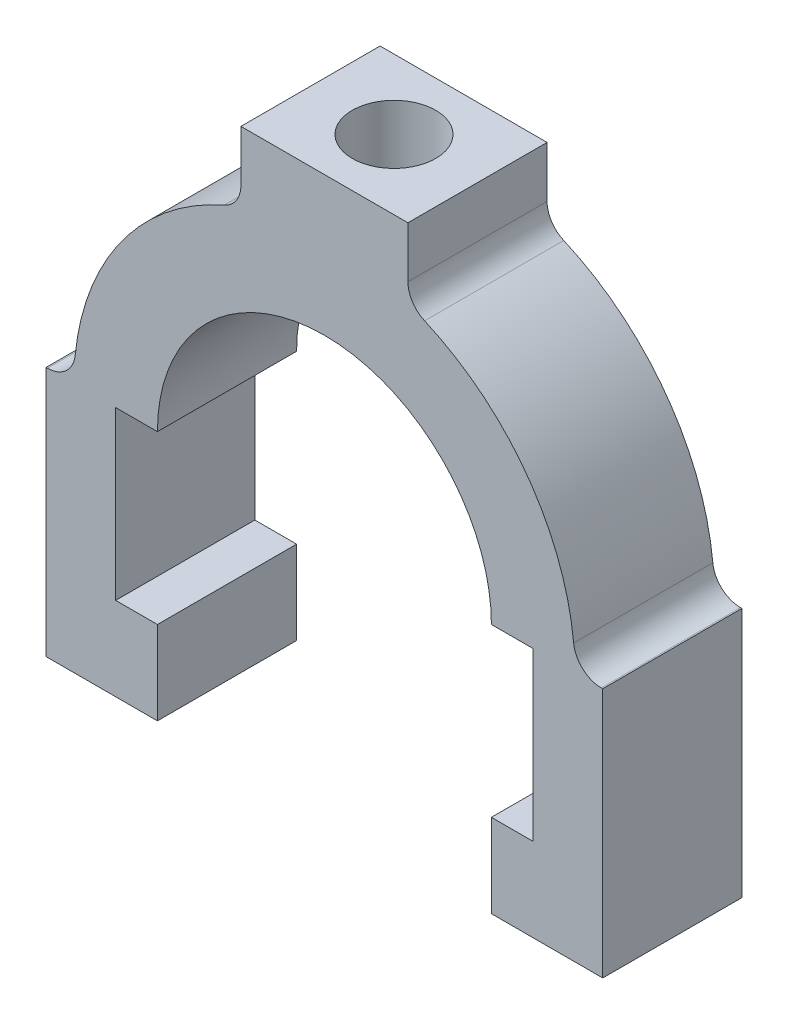
ISO-10303-21;
HEADER;
FILE_DESCRIPTION(('STEP AP214'),'2;1');
FILE_NAME('part.step','',(''),(''),'','','');
FILE_SCHEMA(('AUTOMOTIVE_DESIGN { 1 0 10303 214 1 1 1 1 }'));
ENDSEC;
DATA;
#1=APPLICATION_CONTEXT('core data for automotive mechanical design processes');
#2=APPLICATION_PROTOCOL_DEFINITION('international standard','automotive_design',2000,#1);
#3=PRODUCT_CONTEXT('',#1,'mechanical');
#4=PRODUCT('Part','Part','',(#3));
#5=PRODUCT_RELATED_PRODUCT_CATEGORY('part','',(#4));
#6=PRODUCT_DEFINITION_FORMATION('','',#4);
#7=PRODUCT_DEFINITION_CONTEXT('part definition',#1,'design');
#8=PRODUCT_DEFINITION('design','',#6,#7);
#9=PRODUCT_DEFINITION_SHAPE('','',#8);
#10=(LENGTH_UNIT() NAMED_UNIT(*) SI_UNIT(.MILLI.,.METRE.));
#11=(NAMED_UNIT(*) PLANE_ANGLE_UNIT() SI_UNIT($,.RADIAN.));
#12=(NAMED_UNIT(*) SI_UNIT($,.STERADIAN.) SOLID_ANGLE_UNIT());
#13=UNCERTAINTY_MEASURE_WITH_UNIT(LENGTH_MEASURE(1.E-05),#10,'distance_accuracy_value','');
#14=(GEOMETRIC_REPRESENTATION_CONTEXT(3) GLOBAL_UNCERTAINTY_ASSIGNED_CONTEXT((#13)) GLOBAL_UNIT_ASSIGNED_CONTEXT((#10,
#11,#12)) REPRESENTATION_CONTEXT('',''));
#15=CARTESIAN_POINT('',(0.,0.,0.));
#16=DIRECTION('',(0.,0.,1.));
#17=DIRECTION('',(1.,0.,0.));
#18=AXIS2_PLACEMENT_3D('',#15,#16,#17);
#19=CARTESIAN_POINT('',(70.,36.,-20.));
#20=DIRECTION('',(0.,1.,0.));
#21=DIRECTION('',(0.,0.,1.));
#22=AXIS2_PLACEMENT_3D('',#19,#20,#21);
#23=PLANE('',#22);
#24=DIRECTION('',(-1.,0.,0.));
#25=VECTOR('',#24,1.);
#26=CARTESIAN_POINT('',(70.,36.,-20.));
#27=LINE('',#26,#25);
#28=CARTESIAN_POINT('',(15.9999999999999,36.,-20.));
#29=VERTEX_POINT('',#28);
#30=CARTESIAN_POINT('',(9.99999999999975,36.,-20.));
#31=VERTEX_POINT('',#30);
#32=EDGE_CURVE('E410',#29,#31,#27,.T.);
#33=ORIENTED_EDGE('',*,*,#32,.F.);
#34=DIRECTION('',(0.,0.,1.));
#35=VECTOR('',#34,1.);
#36=CARTESIAN_POINT('',(15.9999999999999,36.,-20.));
#37=LINE('',#36,#35);
#38=CARTESIAN_POINT('',(15.9999999999999,36.,0.));
#39=VERTEX_POINT('',#38);
#40=EDGE_CURVE('E249',#29,#39,#37,.T.);
#41=ORIENTED_EDGE('',*,*,#40,.T.);
#42=DIRECTION('',(-1.,0.,0.));
#43=VECTOR('',#42,1.);
#44=CARTESIAN_POINT('',(70.,36.,0.));
#45=LINE('',#44,#43);
#46=CARTESIAN_POINT('',(9.99999999999975,36.,0.));
#47=VERTEX_POINT('',#46);
#48=EDGE_CURVE('E331',#39,#47,#45,.T.);
#49=ORIENTED_EDGE('',*,*,#48,.T.);
#50=DIRECTION('',(0.,0.,1.));
#51=VECTOR('',#50,1.);
#52=CARTESIAN_POINT('',(9.99999999999975,36.,-20.));
#53=LINE('',#52,#51);
#54=EDGE_CURVE('E341',#31,#47,#53,.T.);
#55=ORIENTED_EDGE('',*,*,#54,.F.);
#56=EDGE_LOOP('',(#33,#41,#49,#55));
#57=FACE_BOUND('',#56,.T.);
#58=ADVANCED_FACE('F32',(#57),#23,.F.);
#59=CARTESIAN_POINT('',(0.,0.,-20.));
#60=DIRECTION('',(0.,-1.,0.));
#61=DIRECTION('',(0.,0.,-1.));
#62=AXIS2_PLACEMENT_3D('',#59,#60,#61);
#63=PLANE('',#62);
#64=DIRECTION('',(0.,0.,1.));
#65=VECTOR('',#64,1.);
#66=CARTESIAN_POINT('',(64.,0.,-20.));
#67=LINE('',#66,#65);
#68=CARTESIAN_POINT('',(64.,0.,-20.));
#69=VERTEX_POINT('',#68);
#70=CARTESIAN_POINT('',(64.,0.,0.));
#71=VERTEX_POINT('',#70);
#72=EDGE_CURVE('E349',#69,#71,#67,.T.);
#73=ORIENTED_EDGE('',*,*,#72,.F.);
#74=DIRECTION('',(1.,0.,0.));
#75=VECTOR('',#74,1.);
#76=CARTESIAN_POINT('',(0.,0.,-20.));
#77=LINE('',#76,#75);
#78=CARTESIAN_POINT('',(80.,0.,-20.));
#79=VERTEX_POINT('',#78);
#80=EDGE_CURVE('E358',#69,#79,#77,.T.);
#81=ORIENTED_EDGE('',*,*,#80,.T.);
#82=DIRECTION('',(0.,0.,1.));
#83=VECTOR('',#82,1.);
#84=CARTESIAN_POINT('',(80.,0.,-20.));
#85=LINE('',#84,#83);
#86=CARTESIAN_POINT('',(80.,0.,0.));
#87=VERTEX_POINT('',#86);
#88=EDGE_CURVE('E224',#79,#87,#85,.T.);
#89=ORIENTED_EDGE('',*,*,#88,.T.);
#90=DIRECTION('',(1.,0.,0.));
#91=VECTOR('',#90,1.);
#92=CARTESIAN_POINT('',(0.,0.,0.));
#93=LINE('',#92,#91);
#94=EDGE_CURVE('E233',#71,#87,#93,.T.);
#95=ORIENTED_EDGE('',*,*,#94,.F.);
#96=EDGE_LOOP('',(#73,#81,#89,#95));
#97=FACE_BOUND('',#96,.T.);
#98=ADVANCED_FACE('F296',(#97),#63,.T.);
#99=CARTESIAN_POINT('',(0.,0.,-20.));
#100=DIRECTION('',(-1.,0.,0.));
#101=DIRECTION('',(0.,0.,1.));
#102=AXIS2_PLACEMENT_3D('',#99,#100,#101);
#103=PLANE('',#102);
#104=DIRECTION('',(0.,0.,1.));
#105=VECTOR('',#104,1.);
#106=CARTESIAN_POINT('',(0.,36.,-20.));
#107=LINE('',#106,#105);
#108=CARTESIAN_POINT('',(0.,36.,-20.));
#109=VERTEX_POINT('',#108);
#110=CARTESIAN_POINT('',(0.,36.,0.));
#111=VERTEX_POINT('',#110);
#112=EDGE_CURVE('E215',#109,#111,#107,.T.);
#113=ORIENTED_EDGE('',*,*,#112,.F.);
#114=DIRECTION('',(0.,-1.,0.));
#115=VECTOR('',#114,1.);
#116=CARTESIAN_POINT('',(0.,0.,-20.));
#117=LINE('',#116,#115);
#118=CARTESIAN_POINT('',(0.,0.,-20.));
#119=VERTEX_POINT('',#118);
#120=EDGE_CURVE('E243',#109,#119,#117,.T.);
#121=ORIENTED_EDGE('',*,*,#120,.T.);
#122=DIRECTION('',(0.,0.,1.));
#123=VECTOR('',#122,1.);
#124=CARTESIAN_POINT('',(0.,0.,-20.));
#125=LINE('',#124,#123);
#126=CARTESIAN_POINT('',(0.,0.,0.));
#127=VERTEX_POINT('',#126);
#128=EDGE_CURVE('E220',#119,#127,#125,.T.);
#129=ORIENTED_EDGE('',*,*,#128,.T.);
#130=DIRECTION('',(0.,-1.,0.));
#131=VECTOR('',#130,1.);
#132=CARTESIAN_POINT('',(0.,0.,0.));
#133=LINE('',#132,#131);
#134=EDGE_CURVE('E231',#111,#127,#133,.T.);
#135=ORIENTED_EDGE('',*,*,#134,.F.);
#136=EDGE_LOOP('',(#113,#121,#129,#135));
#137=FACE_BOUND('',#136,.T.);
#138=ADVANCED_FACE('F303',(#137),#103,.T.);
#139=CARTESIAN_POINT('',(0.,80.,-20.));
#140=DIRECTION('',(0.,1.,0.));
#141=DIRECTION('',(0.,0.,1.));
#142=AXIS2_PLACEMENT_3D('',#139,#140,#141);
#143=PLANE('',#142);
#144=CARTESIAN_POINT('',(39.9999999999959,80.,-9.99999999999545));
#145=DIRECTION('',(0.,1.,0.));
#146=DIRECTION('',(0.,0.,1.));
#147=AXIS2_PLACEMENT_3D('',#144,#145,#146);
#148=CIRCLE('',#147,5.99999999999999);
#149=CARTESIAN_POINT('',(39.9999999999959,80.,-3.99999999999546));
#150=VERTEX_POINT('',#149);
#151=EDGE_CURVE('E262',#150,#150,#148,.T.);
#152=ORIENTED_EDGE('',*,*,#151,.F.);
#153=EDGE_LOOP('',(#152));
#154=FACE_BOUND('',#153,.T.);
#155=DIRECTION('',(0.,0.,1.));
#156=VECTOR('',#155,1.);
#157=CARTESIAN_POINT('',(28.,80.,-20.));
#158=LINE('',#157,#156);
#159=CARTESIAN_POINT('',(28.,80.,-20.));
#160=VERTEX_POINT('',#159);
#161=CARTESIAN_POINT('',(28.,80.,0.));
#162=VERTEX_POINT('',#161);
#163=EDGE_CURVE('E208',#160,#162,#158,.T.);
#164=ORIENTED_EDGE('',*,*,#163,.T.);
#165=DIRECTION('',(-1.,0.,0.));
#166=VECTOR('',#165,1.);
#167=CARTESIAN_POINT('',(0.,80.,0.));
#168=LINE('',#167,#166);
#169=CARTESIAN_POINT('',(51.9999999999994,80.,0.));
#170=VERTEX_POINT('',#169);
#171=EDGE_CURVE('E241',#170,#162,#168,.T.);
#172=ORIENTED_EDGE('',*,*,#171,.F.);
#173=DIRECTION('',(0.,0.,1.));
#174=VECTOR('',#173,1.);
#175=CARTESIAN_POINT('',(51.9999999999994,80.,-20.));
#176=LINE('',#175,#174);
#177=CARTESIAN_POINT('',(51.9999999999994,80.,-20.));
#178=VERTEX_POINT('',#177);
#179=EDGE_CURVE('E219',#178,#170,#176,.T.);
#180=ORIENTED_EDGE('',*,*,#179,.F.);
#181=DIRECTION('',(-1.,0.,0.));
#182=VECTOR('',#181,1.);
#183=CARTESIAN_POINT('',(0.,80.,-20.));
#184=LINE('',#183,#182);
#185=EDGE_CURVE('E197',#178,#160,#184,.T.);
#186=ORIENTED_EDGE('',*,*,#185,.T.);
#187=EDGE_LOOP('',(#164,#172,#180,#186));
#188=FACE_BOUND('',#187,.T.);
#189=ADVANCED_FACE('F218',(#154,#188),#143,.T.);
#190=CARTESIAN_POINT('',(80.,0.,-20.));
#191=DIRECTION('',(1.,0.,0.));
#192=DIRECTION('',(0.,0.,-1.));
#193=AXIS2_PLACEMENT_3D('',#190,#191,#192);
#194=PLANE('',#193);
#195=DIRECTION('',(0.,0.,1.));
#196=VECTOR('',#195,1.);
#197=CARTESIAN_POINT('',(79.9999999999998,36.0000000000005,-20.));
#198=LINE('',#197,#196);
#199=CARTESIAN_POINT('',(79.9999999999998,36.0000000000005,-20.));
#200=VERTEX_POINT('',#199);
#201=CARTESIAN_POINT('',(79.9999999999998,36.0000000000005,0.));
#202=VERTEX_POINT('',#201);
#203=EDGE_CURVE('E383',#200,#202,#198,.T.);
#204=ORIENTED_EDGE('',*,*,#203,.T.);
#205=DIRECTION('',(0.,1.,0.));
#206=VECTOR('',#205,1.);
#207=CARTESIAN_POINT('',(80.,0.,0.));
#208=LINE('',#207,#206);
#209=EDGE_CURVE('E238',#87,#202,#208,.T.);
#210=ORIENTED_EDGE('',*,*,#209,.F.);
#211=ORIENTED_EDGE('',*,*,#88,.F.);
#212=DIRECTION('',(0.,1.,0.));
#213=VECTOR('',#212,1.);
#214=CARTESIAN_POINT('',(80.,0.,-20.));
#215=LINE('',#214,#213);
#216=EDGE_CURVE('E221',#79,#200,#215,.T.);
#217=ORIENTED_EDGE('',*,*,#216,.T.);
#218=EDGE_LOOP('',(#204,#210,#211,#217));
#219=FACE_BOUND('',#218,.T.);
#220=ADVANCED_FACE('F372',(#219),#194,.T.);
#221=DIRECTION('',(0.,0.,1.));
#222=VECTOR('',#221,1.);
#223=CARTESIAN_POINT('',(16.,-2.1812573516776E-13,-20.));
#224=LINE('',#223,#222);
#225=CARTESIAN_POINT('',(16.,-2.1812573516776E-13,-20.));
#226=VERTEX_POINT('',#225);
#227=CARTESIAN_POINT('',(16.,-2.1812573516776E-13,0.));
#228=VERTEX_POINT('',#227);
#229=EDGE_CURVE('E351',#226,#228,#224,.T.);
#230=ORIENTED_EDGE('',*,*,#229,.T.);
#231=EDGE_CURVE('E235',#127,#228,#93,.T.);
#232=ORIENTED_EDGE('',*,*,#231,.F.);
#233=ORIENTED_EDGE('',*,*,#128,.F.);
#234=EDGE_CURVE('E227',#119,#226,#77,.T.);
#235=ORIENTED_EDGE('',*,*,#234,.T.);
#236=EDGE_LOOP('',(#230,#232,#233,#235));
#237=FACE_BOUND('',#236,.T.);
#238=ADVANCED_FACE('F306',(#237),#63,.T.);
#239=CARTESIAN_POINT('',(0.,0.,-20.));
#240=DIRECTION('',(0.,0.,-1.));
#241=DIRECTION('',(-1.,0.,0.));
#242=AXIS2_PLACEMENT_3D('',#239,#240,#241);
#243=PLANE('',#242);
#244=DIRECTION('',(1.,0.,0.));
#245=VECTOR('',#244,1.);
#246=CARTESIAN_POINT('',(3.99999999999987,36.,-20.));
#247=LINE('',#246,#245);
#248=CARTESIAN_POINT('',(0.200502515735071,36.,-20.));
#249=VERTEX_POINT('',#248);
#250=EDGE_CURVE('E204',#109,#249,#247,.T.);
#251=ORIENTED_EDGE('',*,*,#250,.T.);
#252=CARTESIAN_POINT('',(0.200502515735071,40.,-20.));
#253=DIRECTION('',(0.,0.,-1.));
#254=DIRECTION('',(-1.,0.,0.));
#255=AXIS2_PLACEMENT_3D('',#252,#253,#254);
#256=CIRCLE('',#255,4.);
#257=CARTESIAN_POINT('',(4.18045226416155,39.6,-20.));
#258=VERTEX_POINT('',#257);
#259=EDGE_CURVE('E481',#249,#258,#256,.F.);
#260=ORIENTED_EDGE('',*,*,#259,.T.);
#261=CARTESIAN_POINT('',(39.9999999999999,36.,-20.));
#262=DIRECTION('',(0.,0.,-1.));
#263=DIRECTION('',(1.,0.,0.));
#264=AXIS2_PLACEMENT_3D('',#261,#262,#263);
#265=CIRCLE('',#264,36.);
#266=CARTESIAN_POINT('',(25.6,68.9945450036821,-20.));
#267=VERTEX_POINT('',#266);
#268=EDGE_CURVE('E205',#258,#267,#265,.T.);
#269=ORIENTED_EDGE('',*,*,#268,.T.);
#270=CARTESIAN_POINT('',(24.,72.6606055596468,-20.));
#271=DIRECTION('',(0.,0.,-1.));
#272=DIRECTION('',(-1.,0.,0.));
#273=AXIS2_PLACEMENT_3D('',#270,#271,#272);
#274=CIRCLE('',#273,4.);
#275=CARTESIAN_POINT('',(28.,72.6606055596468,-20.));
#276=VERTEX_POINT('',#275);
#277=EDGE_CURVE('E200',#267,#276,#274,.F.);
#278=ORIENTED_EDGE('',*,*,#277,.T.);
#279=DIRECTION('',(0.,1.,0.));
#280=VECTOR('',#279,1.);
#281=CARTESIAN_POINT('',(28.,80.,-20.));
#282=LINE('',#281,#280);
#283=EDGE_CURVE('E192',#276,#160,#282,.T.);
#284=ORIENTED_EDGE('',*,*,#283,.T.);
#285=ORIENTED_EDGE('',*,*,#185,.F.);
#286=DIRECTION('',(0.,-1.,0.));
#287=VECTOR('',#286,1.);
#288=CARTESIAN_POINT('',(51.9999999999994,80.,-20.));
#289=LINE('',#288,#287);
#290=CARTESIAN_POINT('',(51.9999999999995,72.6606055596468,-20.));
#291=VERTEX_POINT('',#290);
#292=EDGE_CURVE('E511',#178,#291,#289,.T.);
#293=ORIENTED_EDGE('',*,*,#292,.T.);
#294=CARTESIAN_POINT('',(55.9999999999995,72.6606055596468,-20.));
#295=DIRECTION('',(0.,0.,-1.));
#296=DIRECTION('',(-1.,0.,0.));
#297=AXIS2_PLACEMENT_3D('',#294,#295,#296);
#298=CIRCLE('',#297,4.);
#299=CARTESIAN_POINT('',(54.3999999999995,68.9945450036822,-20.));
#300=VERTEX_POINT('',#299);
#301=EDGE_CURVE('E11',#291,#300,#298,.F.);
#302=ORIENTED_EDGE('',*,*,#301,.T.);
#303=CARTESIAN_POINT('',(39.9999999999999,36.,-20.));
#304=DIRECTION('',(0.,0.,-1.));
#305=DIRECTION('',(1.,0.,0.));
#306=AXIS2_PLACEMENT_3D('',#303,#304,#305);
#307=CIRCLE('',#306,36.);
#308=CARTESIAN_POINT('',(75.8195477358381,39.6000000000004,-20.));
#309=VERTEX_POINT('',#308);
#310=EDGE_CURVE('E381',#300,#309,#307,.T.);
#311=ORIENTED_EDGE('',*,*,#310,.T.);
#312=CARTESIAN_POINT('',(79.7994974842646,40.0000000000004,-20.));
#313=DIRECTION('',(0.,0.,-1.));
#314=DIRECTION('',(-1.,0.,0.));
#315=AXIS2_PLACEMENT_3D('',#312,#313,#314);
#316=CIRCLE('',#315,4.);
#317=CARTESIAN_POINT('',(79.799497484265,36.0000000000004,-20.));
#318=VERTEX_POINT('',#317);
#319=EDGE_CURVE('E378',#309,#318,#316,.F.);
#320=ORIENTED_EDGE('',*,*,#319,.T.);
#321=DIRECTION('',(1.,1.11022302462519E-13,0.));
#322=VECTOR('',#321,1.);
#323=CARTESIAN_POINT('',(75.9999999999999,36.,-20.));
#324=LINE('',#323,#322);
#325=EDGE_CURVE('E374',#318,#200,#324,.T.);
#326=ORIENTED_EDGE('',*,*,#325,.T.);
#327=ORIENTED_EDGE('',*,*,#216,.F.);
#328=ORIENTED_EDGE('',*,*,#80,.F.);
#329=DIRECTION('',(0.,1.,0.));
#330=VECTOR('',#329,1.);
#331=CARTESIAN_POINT('',(64.,0.,-20.));
#332=LINE('',#331,#330);
#333=CARTESIAN_POINT('',(64.,12.,-20.));
#334=VERTEX_POINT('',#333);
#335=EDGE_CURVE('E402',#69,#334,#332,.T.);
#336=ORIENTED_EDGE('',*,*,#335,.T.);
#337=DIRECTION('',(1.,0.,0.));
#338=VECTOR('',#337,1.);
#339=CARTESIAN_POINT('',(64.,12.,-20.));
#340=LINE('',#339,#338);
#341=CARTESIAN_POINT('',(70.,12.,-20.));
#342=VERTEX_POINT('',#341);
#343=EDGE_CURVE('E404',#334,#342,#340,.T.);
#344=ORIENTED_EDGE('',*,*,#343,.T.);
#345=DIRECTION('',(0.,1.,0.));
#346=VECTOR('',#345,1.);
#347=CARTESIAN_POINT('',(70.,12.,-20.));
#348=LINE('',#347,#346);
#349=CARTESIAN_POINT('',(70.,36.,-20.));
#350=VERTEX_POINT('',#349);
#351=EDGE_CURVE('E407',#342,#350,#348,.T.);
#352=ORIENTED_EDGE('',*,*,#351,.T.);
#353=CARTESIAN_POINT('',(63.9999999999999,36.,-20.));
#354=VERTEX_POINT('',#353);
#355=EDGE_CURVE('E411',#350,#354,#27,.T.);
#356=ORIENTED_EDGE('',*,*,#355,.T.);
#357=CARTESIAN_POINT('',(39.9999999999999,36.,-20.));
#358=DIRECTION('',(0.,0.,1.));
#359=DIRECTION('',(1.,0.,0.));
#360=AXIS2_PLACEMENT_3D('',#357,#358,#359);
#361=CIRCLE('',#360,24.);
#362=EDGE_CURVE('E388',#354,#29,#361,.T.);
#363=ORIENTED_EDGE('',*,*,#362,.T.);
#364=ORIENTED_EDGE('',*,*,#32,.T.);
#365=DIRECTION('',(0.,-1.,0.));
#366=VECTOR('',#365,1.);
#367=CARTESIAN_POINT('',(9.99999999999991,12.,-20.));
#368=LINE('',#367,#366);
#369=CARTESIAN_POINT('',(9.99999999999991,12.,-20.));
#370=VERTEX_POINT('',#369);
#371=EDGE_CURVE('E357',#31,#370,#368,.T.);
#372=ORIENTED_EDGE('',*,*,#371,.T.);
#373=DIRECTION('',(1.,0.,0.));
#374=VECTOR('',#373,1.);
#375=CARTESIAN_POINT('',(15.9999999999999,12.,-20.));
#376=LINE('',#375,#374);
#377=CARTESIAN_POINT('',(15.9999999999999,12.,-20.));
#378=VERTEX_POINT('',#377);
#379=EDGE_CURVE('E334',#370,#378,#376,.T.);
#380=ORIENTED_EDGE('',*,*,#379,.T.);
#381=DIRECTION('',(0.,-1.,0.));
#382=VECTOR('',#381,1.);
#383=CARTESIAN_POINT('',(16.,-2.1812573516776E-13,-20.));
#384=LINE('',#383,#382);
#385=EDGE_CURVE('E399',#378,#226,#384,.T.);
#386=ORIENTED_EDGE('',*,*,#385,.T.);
#387=ORIENTED_EDGE('',*,*,#234,.F.);
#388=ORIENTED_EDGE('',*,*,#120,.F.);
#389=EDGE_LOOP('',(#251,#260,#269,#278,#284,#285,#293,#302,#311,#320,#326,#327,#328,#336,#344,
#352,#356,#363,#364,#372,#380,#386,#387,#388));
#390=FACE_BOUND('',#389,.T.);
#391=ADVANCED_FACE('F195',(#390),#243,.T.);
#392=CARTESIAN_POINT('',(0.,0.,0.));
#393=DIRECTION('',(0.,0.,-1.));
#394=DIRECTION('',(-1.,0.,0.));
#395=AXIS2_PLACEMENT_3D('',#392,#393,#394);
#396=PLANE('',#395);
#397=CARTESIAN_POINT('',(39.9999999999999,36.,0.));
#398=DIRECTION('',(0.,0.,-1.));
#399=DIRECTION('',(1.,0.,0.));
#400=AXIS2_PLACEMENT_3D('',#397,#398,#399);
#401=CIRCLE('',#400,36.);
#402=CARTESIAN_POINT('',(4.18045226416155,39.6,0.));
#403=VERTEX_POINT('',#402);
#404=CARTESIAN_POINT('',(25.6,68.9945450036821,0.));
#405=VERTEX_POINT('',#404);
#406=EDGE_CURVE('E261',#403,#405,#401,.T.);
#407=ORIENTED_EDGE('',*,*,#406,.F.);
#408=CARTESIAN_POINT('',(0.200502515735071,40.,0.));
#409=DIRECTION('',(0.,0.,-1.));
#410=DIRECTION('',(-1.,0.,0.));
#411=AXIS2_PLACEMENT_3D('',#408,#409,#410);
#412=CIRCLE('',#411,4.);
#413=CARTESIAN_POINT('',(0.200502515735071,36.,0.));
#414=VERTEX_POINT('',#413);
#415=EDGE_CURVE('E483',#403,#414,#412,.T.);
#416=ORIENTED_EDGE('',*,*,#415,.T.);
#417=DIRECTION('',(1.,0.,0.));
#418=VECTOR('',#417,1.);
#419=CARTESIAN_POINT('',(3.99999999999987,36.,0.));
#420=LINE('',#419,#418);
#421=EDGE_CURVE('E501',#111,#414,#420,.T.);
#422=ORIENTED_EDGE('',*,*,#421,.F.);
#423=ORIENTED_EDGE('',*,*,#134,.T.);
#424=ORIENTED_EDGE('',*,*,#231,.T.);
#425=DIRECTION('',(0.,-1.,0.));
#426=VECTOR('',#425,1.);
#427=CARTESIAN_POINT('',(16.,-2.1812573516776E-13,0.));
#428=LINE('',#427,#426);
#429=CARTESIAN_POINT('',(15.9999999999999,12.,0.));
#430=VERTEX_POINT('',#429);
#431=EDGE_CURVE('E416',#430,#228,#428,.T.);
#432=ORIENTED_EDGE('',*,*,#431,.F.);
#433=DIRECTION('',(1.,0.,0.));
#434=VECTOR('',#433,1.);
#435=CARTESIAN_POINT('',(15.9999999999999,12.,0.));
#436=LINE('',#435,#434);
#437=CARTESIAN_POINT('',(9.99999999999991,12.,0.));
#438=VERTEX_POINT('',#437);
#439=EDGE_CURVE('E395',#438,#430,#436,.T.);
#440=ORIENTED_EDGE('',*,*,#439,.F.);
#441=DIRECTION('',(0.,-1.,0.));
#442=VECTOR('',#441,1.);
#443=CARTESIAN_POINT('',(9.99999999999991,12.,0.));
#444=LINE('',#443,#442);
#445=EDGE_CURVE('E330',#47,#438,#444,.T.);
#446=ORIENTED_EDGE('',*,*,#445,.F.);
#447=ORIENTED_EDGE('',*,*,#48,.F.);
#448=CARTESIAN_POINT('',(39.9999999999999,36.,0.));
#449=DIRECTION('',(0.,0.,1.));
#450=DIRECTION('',(1.,0.,0.));
#451=AXIS2_PLACEMENT_3D('',#448,#449,#450);
#452=CIRCLE('',#451,24.);
#453=CARTESIAN_POINT('',(63.9999999999999,36.,0.));
#454=VERTEX_POINT('',#453);
#455=EDGE_CURVE('E386',#454,#39,#452,.T.);
#456=ORIENTED_EDGE('',*,*,#455,.F.);
#457=CARTESIAN_POINT('',(70.,36.,0.));
#458=VERTEX_POINT('',#457);
#459=EDGE_CURVE('E323',#458,#454,#45,.T.);
#460=ORIENTED_EDGE('',*,*,#459,.F.);
#461=DIRECTION('',(0.,1.,0.));
#462=VECTOR('',#461,1.);
#463=CARTESIAN_POINT('',(70.,12.,0.));
#464=LINE('',#463,#462);
#465=CARTESIAN_POINT('',(70.,12.,0.));
#466=VERTEX_POINT('',#465);
#467=EDGE_CURVE('E336',#466,#458,#464,.T.);
#468=ORIENTED_EDGE('',*,*,#467,.F.);
#469=DIRECTION('',(1.,0.,0.));
#470=VECTOR('',#469,1.);
#471=CARTESIAN_POINT('',(64.,12.,0.));
#472=LINE('',#471,#470);
#473=CARTESIAN_POINT('',(64.,12.,0.));
#474=VERTEX_POINT('',#473);
#475=EDGE_CURVE('E420',#474,#466,#472,.T.);
#476=ORIENTED_EDGE('',*,*,#475,.F.);
#477=DIRECTION('',(0.,1.,0.));
#478=VECTOR('',#477,1.);
#479=CARTESIAN_POINT('',(64.,0.,0.));
#480=LINE('',#479,#478);
#481=EDGE_CURVE('E418',#71,#474,#480,.T.);
#482=ORIENTED_EDGE('',*,*,#481,.F.);
#483=ORIENTED_EDGE('',*,*,#94,.T.);
#484=ORIENTED_EDGE('',*,*,#209,.T.);
#485=DIRECTION('',(1.,1.11022302462519E-13,0.));
#486=VECTOR('',#485,1.);
#487=CARTESIAN_POINT('',(75.9999999999999,36.,0.));
#488=LINE('',#487,#486);
#489=CARTESIAN_POINT('',(79.799497484265,36.0000000000004,0.));
#490=VERTEX_POINT('',#489);
#491=EDGE_CURVE('E385',#490,#202,#488,.T.);
#492=ORIENTED_EDGE('',*,*,#491,.F.);
#493=CARTESIAN_POINT('',(79.7994974842646,40.0000000000004,0.));
#494=DIRECTION('',(0.,0.,-1.));
#495=DIRECTION('',(-1.,0.,0.));
#496=AXIS2_PLACEMENT_3D('',#493,#494,#495);
#497=CIRCLE('',#496,4.);
#498=CARTESIAN_POINT('',(75.8195477358381,39.6000000000004,0.));
#499=VERTEX_POINT('',#498);
#500=EDGE_CURVE('E474',#490,#499,#497,.T.);
#501=ORIENTED_EDGE('',*,*,#500,.T.);
#502=CARTESIAN_POINT('',(39.9999999999999,36.,0.));
#503=DIRECTION('',(0.,0.,-1.));
#504=DIRECTION('',(1.,0.,0.));
#505=AXIS2_PLACEMENT_3D('',#502,#503,#504);
#506=CIRCLE('',#505,36.);
#507=CARTESIAN_POINT('',(54.3999999999995,68.9945450036822,0.));
#508=VERTEX_POINT('',#507);
#509=EDGE_CURVE('E514',#508,#499,#506,.T.);
#510=ORIENTED_EDGE('',*,*,#509,.F.);
#511=CARTESIAN_POINT('',(55.9999999999995,72.6606055596468,0.));
#512=DIRECTION('',(0.,0.,-1.));
#513=DIRECTION('',(-1.,0.,0.));
#514=AXIS2_PLACEMENT_3D('',#511,#512,#513);
#515=CIRCLE('',#514,4.);
#516=CARTESIAN_POINT('',(51.9999999999995,72.6606055596468,0.));
#517=VERTEX_POINT('',#516);
#518=EDGE_CURVE('E40',#508,#517,#515,.T.);
#519=ORIENTED_EDGE('',*,*,#518,.T.);
#520=DIRECTION('',(0.,-1.,0.));
#521=VECTOR('',#520,1.);
#522=CARTESIAN_POINT('',(51.9999999999994,80.,0.));
#523=LINE('',#522,#521);
#524=EDGE_CURVE('E509',#170,#517,#523,.T.);
#525=ORIENTED_EDGE('',*,*,#524,.F.);
#526=ORIENTED_EDGE('',*,*,#171,.T.);
#527=DIRECTION('',(0.,1.,0.));
#528=VECTOR('',#527,1.);
#529=CARTESIAN_POINT('',(28.,80.,0.));
#530=LINE('',#529,#528);
#531=CARTESIAN_POINT('',(28.,72.6606055596468,0.));
#532=VERTEX_POINT('',#531);
#533=EDGE_CURVE('E211',#532,#162,#530,.T.);
#534=ORIENTED_EDGE('',*,*,#533,.F.);
#535=CARTESIAN_POINT('',(24.,72.6606055596468,0.));
#536=DIRECTION('',(0.,0.,-1.));
#537=DIRECTION('',(-1.,0.,0.));
#538=AXIS2_PLACEMENT_3D('',#535,#536,#537);
#539=CIRCLE('',#538,4.);
#540=EDGE_CURVE('E479',#532,#405,#539,.T.);
#541=ORIENTED_EDGE('',*,*,#540,.T.);
#542=EDGE_LOOP('',(#407,#416,#422,#423,#424,#432,#440,#446,#447,#456,#460,#468,#476,#482,#483,
#484,#492,#501,#510,#519,#525,#526,#534,#541));
#543=FACE_BOUND('',#542,.T.);
#544=ADVANCED_FACE('F426',(#543),#396,.F.);
#545=CARTESIAN_POINT('',(15.9999999999999,12.,-20.));
#546=DIRECTION('',(0.,-1.,0.));
#547=DIRECTION('',(1.,0.,0.));
#548=AXIS2_PLACEMENT_3D('',#545,#546,#547);
#549=PLANE('',#548);
#550=ORIENTED_EDGE('',*,*,#439,.T.);
#551=DIRECTION('',(0.,0.,1.));
#552=VECTOR('',#551,1.);
#553=CARTESIAN_POINT('',(15.9999999999999,12.,-20.));
#554=LINE('',#553,#552);
#555=EDGE_CURVE('E354',#378,#430,#554,.T.);
#556=ORIENTED_EDGE('',*,*,#555,.F.);
#557=ORIENTED_EDGE('',*,*,#379,.F.);
#558=DIRECTION('',(0.,0.,1.));
#559=VECTOR('',#558,1.);
#560=CARTESIAN_POINT('',(9.99999999999991,12.,-20.));
#561=LINE('',#560,#559);
#562=EDGE_CURVE('E234',#370,#438,#561,.T.);
#563=ORIENTED_EDGE('',*,*,#562,.T.);
#564=EDGE_LOOP('',(#550,#556,#557,#563));
#565=FACE_BOUND('',#564,.T.);
#566=ADVANCED_FACE('F319',(#565),#549,.F.);
#567=CARTESIAN_POINT('',(9.99999999999991,12.,-20.));
#568=DIRECTION('',(-1.,0.,0.));
#569=DIRECTION('',(0.,-1.,0.));
#570=AXIS2_PLACEMENT_3D('',#567,#568,#569);
#571=PLANE('',#570);
#572=ORIENTED_EDGE('',*,*,#445,.T.);
#573=ORIENTED_EDGE('',*,*,#562,.F.);
#574=ORIENTED_EDGE('',*,*,#371,.F.);
#575=ORIENTED_EDGE('',*,*,#54,.T.);
#576=EDGE_LOOP('',(#572,#573,#574,#575));
#577=FACE_BOUND('',#576,.T.);
#578=ADVANCED_FACE('F311',(#577),#571,.F.);
#579=ORIENTED_EDGE('',*,*,#459,.T.);
#580=DIRECTION('',(0.,0.,1.));
#581=VECTOR('',#580,1.);
#582=CARTESIAN_POINT('',(63.9999999999999,36.,-20.));
#583=LINE('',#582,#581);
#584=EDGE_CURVE('E245',#454,#354,#583,.F.);
#585=ORIENTED_EDGE('',*,*,#584,.T.);
#586=ORIENTED_EDGE('',*,*,#355,.F.);
#587=DIRECTION('',(0.,0.,1.));
#588=VECTOR('',#587,1.);
#589=CARTESIAN_POINT('',(70.,36.,-20.));
#590=LINE('',#589,#588);
#591=EDGE_CURVE('E326',#350,#458,#590,.T.);
#592=ORIENTED_EDGE('',*,*,#591,.T.);
#593=EDGE_LOOP('',(#579,#585,#586,#592));
#594=FACE_BOUND('',#593,.T.);
#595=ADVANCED_FACE('F299',(#594),#23,.F.);
#596=CARTESIAN_POINT('',(70.,12.,-20.));
#597=DIRECTION('',(1.,0.,0.));
#598=DIRECTION('',(0.,0.,-1.));
#599=AXIS2_PLACEMENT_3D('',#596,#597,#598);
#600=PLANE('',#599);
#601=ORIENTED_EDGE('',*,*,#467,.T.);
#602=ORIENTED_EDGE('',*,*,#591,.F.);
#603=ORIENTED_EDGE('',*,*,#351,.F.);
#604=DIRECTION('',(0.,0.,1.));
#605=VECTOR('',#604,1.);
#606=CARTESIAN_POINT('',(70.,12.,-20.));
#607=LINE('',#606,#605);
#608=EDGE_CURVE('E345',#342,#466,#607,.T.);
#609=ORIENTED_EDGE('',*,*,#608,.T.);
#610=EDGE_LOOP('',(#601,#602,#603,#609));
#611=FACE_BOUND('',#610,.T.);
#612=ADVANCED_FACE('F310',(#611),#600,.F.);
#613=CARTESIAN_POINT('',(64.,12.,-20.));
#614=DIRECTION('',(0.,-1.,0.));
#615=DIRECTION('',(1.,0.,0.));
#616=AXIS2_PLACEMENT_3D('',#613,#614,#615);
#617=PLANE('',#616);
#618=ORIENTED_EDGE('',*,*,#475,.T.);
#619=ORIENTED_EDGE('',*,*,#608,.F.);
#620=ORIENTED_EDGE('',*,*,#343,.F.);
#621=DIRECTION('',(0.,0.,1.));
#622=VECTOR('',#621,1.);
#623=CARTESIAN_POINT('',(64.,12.,-20.));
#624=LINE('',#623,#622);
#625=EDGE_CURVE('E347',#334,#474,#624,.T.);
#626=ORIENTED_EDGE('',*,*,#625,.T.);
#627=EDGE_LOOP('',(#618,#619,#620,#626));
#628=FACE_BOUND('',#627,.T.);
#629=ADVANCED_FACE('F317',(#628),#617,.F.);
#630=CARTESIAN_POINT('',(64.,0.,-20.));
#631=DIRECTION('',(1.,0.,0.));
#632=DIRECTION('',(0.,0.,-1.));
#633=AXIS2_PLACEMENT_3D('',#630,#631,#632);
#634=PLANE('',#633);
#635=ORIENTED_EDGE('',*,*,#481,.T.);
#636=ORIENTED_EDGE('',*,*,#625,.F.);
#637=ORIENTED_EDGE('',*,*,#335,.F.);
#638=ORIENTED_EDGE('',*,*,#72,.T.);
#639=EDGE_LOOP('',(#635,#636,#637,#638));
#640=FACE_BOUND('',#639,.T.);
#641=ADVANCED_FACE('F429',(#640),#634,.F.);
#642=CARTESIAN_POINT('',(16.,-2.1812573516776E-13,-20.));
#643=DIRECTION('',(-1.,0.,0.));
#644=DIRECTION('',(0.,-1.,0.));
#645=AXIS2_PLACEMENT_3D('',#642,#643,#644);
#646=PLANE('',#645);
#647=ORIENTED_EDGE('',*,*,#431,.T.);
#648=ORIENTED_EDGE('',*,*,#229,.F.);
#649=ORIENTED_EDGE('',*,*,#385,.F.);
#650=ORIENTED_EDGE('',*,*,#555,.T.);
#651=EDGE_LOOP('',(#647,#648,#649,#650));
#652=FACE_BOUND('',#651,.T.);
#653=ADVANCED_FACE('F436',(#652),#646,.F.);
#654=CARTESIAN_POINT('',(39.9999999999999,36.,-20.));
#655=DIRECTION('',(0.,0.,1.));
#656=DIRECTION('',(1.,0.,0.));
#657=AXIS2_PLACEMENT_3D('',#654,#655,#656);
#658=CYLINDRICAL_SURFACE('',#657,24.);
#659=CARTESIAN_POINT('',(39.9999999999959,60.,-3.99999999999546));
#660=CARTESIAN_POINT('',(40.1658053873997,60.0000029962767,-3.99999505102187));
#661=CARTESIAN_POINT('',(40.3315566180916,59.9982792337244,-4.00687387488789));
#662=CARTESIAN_POINT('',(40.6618983414956,59.9914389070727,-4.03431986201183));
#663=CARTESIAN_POINT('',(40.8264886996081,59.9863219558733,-4.05488858703561));
#664=CARTESIAN_POINT('',(41.1533146828901,59.972831274781,-4.10955571939094));
#665=CARTESIAN_POINT('',(41.3155495613562,59.9644565345612,-4.1436583240039));
#666=CARTESIAN_POINT('',(41.6365299935297,59.9446785682945,-4.22512392789194));
#667=CARTESIAN_POINT('',(41.7952742379131,59.9332742261504,-4.27249181441058));
#668=CARTESIAN_POINT('',(42.1078589082672,59.9077704080527,-4.38001719826583));
#669=CARTESIAN_POINT('',(42.2617067496308,59.8936752583921,-4.44015418257769));
#670=CARTESIAN_POINT('',(42.5637862382084,59.863152708192,-4.5728254102112));
#671=CARTESIAN_POINT('',(42.7120157871239,59.8467244469553,-4.64536423065792));
#672=CARTESIAN_POINT('',(43.0017766103313,59.811984898181,-4.80226274512451));
#673=CARTESIAN_POINT('',(43.1433102969321,59.7936742964522,-4.88661813794721));
#674=CARTESIAN_POINT('',(43.4188852665407,59.7556431475745,-5.06661176458582));
#675=CARTESIAN_POINT('',(43.5529237053407,59.7359220715787,-5.16225423923962));
#676=CARTESIAN_POINT('',(43.8149643460196,59.6952304700185,-5.36598591724456));
#677=CARTESIAN_POINT('',(43.9428130891279,59.6742437759667,-5.47426931255102));
#678=CARTESIAN_POINT('',(44.1890273684126,59.6319204183461,-5.70115303310639));
#679=CARTESIAN_POINT('',(44.3073893684654,59.6105836278183,-5.8197571713063));
#680=CARTESIAN_POINT('',(44.5337748952359,59.5681596204789,-6.06643888329406));
#681=CARTESIAN_POINT('',(44.6418010318507,59.5470723418482,-6.19451405100492));
#682=CARTESIAN_POINT('',(44.8468631629942,59.5057198367553,-6.45938141653214));
#683=CARTESIAN_POINT('',(44.9438950855675,59.4854549166443,-6.59617681496134));
#684=CARTESIAN_POINT('',(45.1275757933381,59.4460427828095,-6.87960061394094));
#685=CARTESIAN_POINT('',(45.2140532907285,59.4269160793518,-7.02634297895873));
#686=CARTESIAN_POINT('',(45.3743409923865,59.3906650895741,-7.32689631113694));
#687=CARTESIAN_POINT('',(45.4481464054061,59.3735415614203,-7.48070992415522));
#688=CARTESIAN_POINT('',(45.5824381696163,59.3418328254514,-7.79422880997834));
#689=CARTESIAN_POINT('',(45.6429311269965,59.3272463593982,-7.95393111442328));
#690=CARTESIAN_POINT('',(45.7501625606028,59.301043510544,-8.27812298906242));
#691=CARTESIAN_POINT('',(45.796896111307,59.2894281915338,-8.44261425048402));
#692=CARTESIAN_POINT('',(45.9141515731625,59.2600431044572,-8.93482169258192));
#693=CARTESIAN_POINT('',(45.9645898609191,59.2470332112992,-9.26798361707147));
#694=CARTESIAN_POINT('',(45.9979584834919,59.238426088561,-9.77014845135565));
#695=CARTESIAN_POINT('',(46.0020266361354,59.2373766993868,-9.93800547716484));
#696=CARTESIAN_POINT('',(45.9961097080035,59.2389046091492,-10.2734756491511));
#697=CARTESIAN_POINT('',(45.9861244882233,59.2414819439585,-10.4410887928995));
#698=CARTESIAN_POINT('',(45.9359471347418,59.2543754061862,-10.9334757617662));
#699=CARTESIAN_POINT('',(45.8760736384791,59.2697164452638,-11.2563322349653));
#700=CARTESIAN_POINT('',(45.7048964698067,59.3122664593655,-11.8870944582539));
#701=CARTESIAN_POINT('',(45.5935891334856,59.3394762798596,-12.1949991415192));
#702=CARTESIAN_POINT('',(45.3215579872901,59.4030050803757,-12.7909383990186));
#703=CARTESIAN_POINT('',(45.1603466891924,59.439413239382,-13.0787410216408));
#704=CARTESIAN_POINT('',(44.7934250837872,59.5171882932274,-13.6236785051775));
#705=CARTESIAN_POINT('',(44.5877069897224,59.5585560552164,-13.8808079873958));
#706=CARTESIAN_POINT('',(44.1306537043866,59.6430352608543,-14.3648134392663));
#707=CARTESIAN_POINT('',(43.8781850342051,59.6861627896449,-14.590617686056));
#708=CARTESIAN_POINT('',(43.3384476684647,59.7682386126264,-14.9968852440443));
#709=CARTESIAN_POINT('',(43.0511779103101,59.8071867791386,-15.1773471702701));
#710=CARTESIAN_POINT('',(42.4484635552407,59.876709286616,-15.4882022714212));
#711=CARTESIAN_POINT('',(42.1329255733544,59.9072544059239,-15.6184213427013));
#712=CARTESIAN_POINT('',(41.4835040320433,59.9563166788426,-15.8236692411421));
#713=CARTESIAN_POINT('',(41.149623995021,59.9748361331615,-15.8987086254509));
#714=CARTESIAN_POINT('',(40.4821598830924,59.9974199712545,-15.9898302624423));
#715=CARTESIAN_POINT('',(40.1487868855182,60.0018421411353,-16.0073721225153));
#716=CARTESIAN_POINT('',(39.4838684952209,59.9967521917739,-15.9870039735564));
#717=CARTESIAN_POINT('',(39.1523229406786,59.9872413268569,-15.9490989561455));
#718=CARTESIAN_POINT('',(38.5055429453215,59.9555832478691,-15.8201164380068));
#719=CARTESIAN_POINT('',(38.1901395998364,59.9336253776698,-15.7298352125922));
#720=CARTESIAN_POINT('',(37.5789707544627,59.8795482551263,-15.49957139735));
#721=CARTESIAN_POINT('',(37.2832072413931,59.8474279766141,-15.3595837881536));
#722=CARTESIAN_POINT('',(36.7139077497612,59.7757323559105,-15.0310564967342));
#723=CARTESIAN_POINT('',(36.4408593143594,59.7360348408849,-14.8416993592079));
#724=CARTESIAN_POINT('',(35.9298924635293,59.6537802212627,-14.4208365553503));
#725=CARTESIAN_POINT('',(35.6919801237396,59.6112226239552,-14.18932361497));
#726=CARTESIAN_POINT('',(35.2520418672435,59.5267588379472,-13.6840067323784));
#727=CARTESIAN_POINT('',(35.0510401552213,59.4848942795261,-13.4093042078126));
#728=CARTESIAN_POINT('',(34.6979413389253,59.4077130231467,-12.8290144447485));
#729=CARTESIAN_POINT('',(34.5458420638434,59.3723960345674,-12.5234285779719));
#730=CARTESIAN_POINT('',(34.3583912928672,59.3275859445672,-12.0496398809801));
#731=CARTESIAN_POINT('',(34.3027784186106,59.3140336618741,-11.8895567216992));
#732=CARTESIAN_POINT('',(34.2052423079103,59.2899834650224,-11.5650651703003));
#733=CARTESIAN_POINT('',(34.1633138849385,59.2794843938345,-11.4006584424418));
#734=CARTESIAN_POINT('',(34.0935100254597,59.2618715740412,-11.0687170513361));
#735=CARTESIAN_POINT('',(34.0656348266098,59.2547578826868,-10.9011823352404));
#736=CARTESIAN_POINT('',(34.0241791493654,59.2441396190318,-10.5642421336304));
#737=CARTESIAN_POINT('',(34.0105979999151,59.2406348773038,-10.3948367363153));
#738=CARTESIAN_POINT('',(33.9980365271424,59.2373938489055,-10.0603310550515));
#739=CARTESIAN_POINT('',(33.9986477945838,59.2375521518768,-9.89524696864831));
#740=CARTESIAN_POINT('',(34.0134642369322,59.2413736324525,-9.56573349983861));
#741=CARTESIAN_POINT('',(34.0276691024828,59.2450367302965,-9.40130410261846));
#742=CARTESIAN_POINT('',(34.0695542448989,59.2557579721318,-9.07425896558329));
#743=CARTESIAN_POINT('',(34.0972365870921,59.2628166364676,-8.91164350764972));
#744=CARTESIAN_POINT('',(34.1658333209113,59.2801148571714,-8.58946233313707));
#745=CARTESIAN_POINT('',(34.2067430491326,59.2903532924395,-8.42989556268977));
#746=CARTESIAN_POINT('',(34.3011979628287,59.313644179092,-8.11574761366938));
#747=CARTESIAN_POINT('',(34.3546705635633,59.3266804293968,-7.96114338738522));
#748=CARTESIAN_POINT('',(34.4739414711601,59.3552228194449,-7.65706577640845));
#749=CARTESIAN_POINT('',(34.5397355019755,59.370728102053,-7.50759063294127));
#750=CARTESIAN_POINT('',(34.6832116445755,59.4037855982128,-7.21461325500868));
#751=CARTESIAN_POINT('',(34.7608991008704,59.4213387311525,-7.07111374285341));
#752=CARTESIAN_POINT('',(34.9275692602894,59.4579990976348,-6.79110854338654));
#753=CARTESIAN_POINT('',(35.0165482595036,59.4771058208258,-6.6546005831875));
#754=CARTESIAN_POINT('',(35.207727096712,59.5168854335103,-6.3858573209119));
#755=CARTESIAN_POINT('',(35.310214438781,59.5375863850886,-6.25383061677498));
#756=CARTESIAN_POINT('',(35.5257565481494,59.5795078828382,-5.99887487156256));
#757=CARTESIAN_POINT('',(35.6388077132785,59.6007282500849,-5.87594275474734));
#758=CARTESIAN_POINT('',(35.8748358045263,59.6431258862832,-5.63985111466121));
#759=CARTESIAN_POINT('',(35.9978185542658,59.664303122373,-5.52669740687485));
#760=CARTESIAN_POINT('',(36.2528082349816,59.7060168559158,-5.31103132209201));
#761=CARTESIAN_POINT('',(36.384811865791,59.726553583728,-5.20851508772077));
#762=CARTESIAN_POINT('',(36.659558132935,59.7668061369622,-5.01297680605116));
#763=CARTESIAN_POINT('',(36.8024544613907,59.7864996932663,-4.92016593893678));
#764=CARTESIAN_POINT('',(37.0957434714254,59.8240874858075,-4.74697329866155));
#765=CARTESIAN_POINT('',(37.2461333697675,59.8419823827548,-4.66658695566306));
#766=CARTESIAN_POINT('',(37.5533630711415,59.8754647710397,-4.51885051283659));
#767=CARTESIAN_POINT('',(37.710200058444,59.8910532562912,-4.4514947937833));
#768=CARTESIAN_POINT('',(38.0292099816893,59.9194829588899,-4.33033364450261));
#769=CARTESIAN_POINT('',(38.1913821085117,59.9323245906254,-4.27652617017955));
#770=CARTESIAN_POINT('',(38.6222236952664,59.961904956824,-4.15376714609115));
#771=CARTESIAN_POINT('',(38.8944085273381,59.9761014751909,-4.09620462215473));
#772=CARTESIAN_POINT('',(39.4444464975513,59.9951461360495,-4.01932663185641));
#773=CARTESIAN_POINT('',(39.7222992077763,59.9999949816564,-4.00000828883279));
#774=CARTESIAN_POINT('',(39.9999999999959,60.,-3.99999999999546));
#775=B_SPLINE_CURVE_WITH_KNOTS('',3,(#659,#660,#661,#662,#663,#664,#665,#666,#667,#668,#669,
#670,#671,#672,#673,#674,#675,#676,#677,#678,#679,#680,#681,#682,#683,#684,#685,#686,#687,#688,
#689,#690,#691,#692,#693,#694,#695,#696,#697,#698,#699,#700,#701,#702,#703,#704,#705,#706,#707,
#708,#709,#710,#711,#712,#713,#714,#715,#716,#717,#718,#719,#720,#721,#722,#723,#724,#725,#726,
#727,#728,#729,#730,#731,#732,#733,#734,#735,#736,#737,#738,#739,#740,#741,#742,#743,#744,#745,
#746,#747,#748,#749,#750,#751,#752,#753,#754,#755,#756,#757,#758,#759,#760,#761,#762,#763,#764,
#765,#766,#767,#768,#769,#770,#771,#772,#773,#774),.UNSPECIFIED.,.T.,.F.,(4,2,2,2,2,2,2,2,2,2,2,
2,2,2,2,2,2,2,2,2,2,2,2,2,2,2,2,2,2,2,2,2,2,2,2,2,2,2,2,2,2,2,2,2,2,2,2,2,2,2,2,2,2,2,2,2,2,4),
(0.,0.49717145360833,0.994399635056312,1.49178214324904,1.98934814054328,2.48612078574431,
2.98307717135295,3.47985313409868,3.97681634579041,4.48278784834541,4.98894707988192,
5.49497816255304,6.0011960568214,6.51476681838421,7.02853133276335,7.54204031819862,
8.05573290406756,9.06140626133563,9.5646305595795,10.0678598353588,11.0489981911532,
12.0302064495332,13.0213194258469,14.0126059443383,15.0321583496525,16.0517418932216,
17.0748274712563,18.0977172584374,19.0944306688627,20.0910543554013,21.0729092914531,
22.0548634037832,23.0542418135057,24.0537928312124,25.0778786790707,26.1019190608721,
26.6114255778036,27.1207387624018,27.6300605598218,28.1393584452953,28.6340191333342,
29.1286685643952,29.6233938208456,30.1179448483895,30.6097058740943,31.1012965535398,
31.5931087894518,32.0847601135966,32.5894192432001,33.0939069121444,33.5986925778492,
34.103294553071,34.6172488082309,35.1310135748028,35.644556293157,36.1580214841034,
36.9907766489354,37.8234691729711),.UNSPECIFIED.);
#776=CARTESIAN_POINT('',(39.9999999999959,60.,-3.99999999999546));
#777=VERTEX_POINT('',#776);
#778=EDGE_CURVE('E253',#777,#777,#775,.T.);
#779=ORIENTED_EDGE('',*,*,#778,.T.);
#780=EDGE_LOOP('',(#779));
#781=FACE_BOUND('',#780,.T.);
#782=ORIENTED_EDGE('',*,*,#362,.F.);
#783=ORIENTED_EDGE('',*,*,#584,.F.);
#784=ORIENTED_EDGE('',*,*,#455,.T.);
#785=ORIENTED_EDGE('',*,*,#40,.F.);
#786=EDGE_LOOP('',(#782,#783,#784,#785));
#787=FACE_BOUND('',#786,.T.);
#788=ADVANCED_FACE('F264',(#781,#787),#658,.F.);
#789=CARTESIAN_POINT('',(75.9999999999999,36.,-20.));
#790=DIRECTION('',(1.11022302462519E-13,-1.,0.));
#791=DIRECTION('',(1.,1.11022302462519E-13,0.));
#792=AXIS2_PLACEMENT_3D('',#789,#790,#791);
#793=PLANE('',#792);
#794=ORIENTED_EDGE('',*,*,#325,.F.);
#795=DIRECTION('',(0.,0.,-1.));
#796=VECTOR('',#795,1.);
#797=CARTESIAN_POINT('',(79.799497484265,36.0000000000004,0.));
#798=LINE('',#797,#796);
#799=EDGE_CURVE('E473',#318,#490,#798,.F.);
#800=ORIENTED_EDGE('',*,*,#799,.T.);
#801=ORIENTED_EDGE('',*,*,#491,.T.);
#802=ORIENTED_EDGE('',*,*,#203,.F.);
#803=EDGE_LOOP('',(#794,#800,#801,#802));
#804=FACE_BOUND('',#803,.T.);
#805=ADVANCED_FACE('F285',(#804),#793,.F.);
#806=CARTESIAN_POINT('',(39.9999999999999,36.,-20.));
#807=DIRECTION('',(0.,0.,1.));
#808=DIRECTION('',(1.,0.,0.));
#809=AXIS2_PLACEMENT_3D('',#806,#807,#808);
#810=CYLINDRICAL_SURFACE('',#809,36.);
#811=ORIENTED_EDGE('',*,*,#509,.T.);
#812=DIRECTION('',(0.,0.,1.));
#813=VECTOR('',#812,1.);
#814=CARTESIAN_POINT('',(75.8195477358381,39.6000000000004,-20.));
#815=LINE('',#814,#813);
#816=EDGE_CURVE('E472',#499,#309,#815,.F.);
#817=ORIENTED_EDGE('',*,*,#816,.T.);
#818=ORIENTED_EDGE('',*,*,#310,.F.);
#819=DIRECTION('',(0.,0.,1.));
#820=VECTOR('',#819,1.);
#821=CARTESIAN_POINT('',(54.3999999999995,68.9945450036822,-20.));
#822=LINE('',#821,#820);
#823=EDGE_CURVE('E487',#300,#508,#822,.T.);
#824=ORIENTED_EDGE('',*,*,#823,.T.);
#825=EDGE_LOOP('',(#811,#817,#818,#824));
#826=FACE_BOUND('',#825,.T.);
#827=ADVANCED_FACE('F288',(#826),#810,.T.);
#828=CARTESIAN_POINT('',(51.9999999999994,80.,-20.));
#829=DIRECTION('',(-1.,0.,0.));
#830=DIRECTION('',(0.,-1.,0.));
#831=AXIS2_PLACEMENT_3D('',#828,#829,#830);
#832=PLANE('',#831);
#833=ORIENTED_EDGE('',*,*,#524,.T.);
#834=DIRECTION('',(0.,0.,-1.));
#835=VECTOR('',#834,1.);
#836=CARTESIAN_POINT('',(51.9999999999995,72.6606055596468,-20.));
#837=LINE('',#836,#835);
#838=EDGE_CURVE('E47',#517,#291,#837,.T.);
#839=ORIENTED_EDGE('',*,*,#838,.T.);
#840=ORIENTED_EDGE('',*,*,#292,.F.);
#841=ORIENTED_EDGE('',*,*,#179,.T.);
#842=EDGE_LOOP('',(#833,#839,#840,#841));
#843=FACE_BOUND('',#842,.T.);
#844=ADVANCED_FACE('F283',(#843),#832,.F.);
#845=CARTESIAN_POINT('',(39.9999999999999,36.,-20.));
#846=DIRECTION('',(0.,0.,1.));
#847=DIRECTION('',(1.,0.,0.));
#848=AXIS2_PLACEMENT_3D('',#845,#846,#847);
#849=CYLINDRICAL_SURFACE('',#848,36.);
#850=ORIENTED_EDGE('',*,*,#268,.F.);
#851=DIRECTION('',(0.,0.,1.));
#852=VECTOR('',#851,1.);
#853=CARTESIAN_POINT('',(4.18045226416155,39.6,-20.));
#854=LINE('',#853,#852);
#855=EDGE_CURVE('E494',#258,#403,#854,.T.);
#856=ORIENTED_EDGE('',*,*,#855,.T.);
#857=ORIENTED_EDGE('',*,*,#406,.T.);
#858=DIRECTION('',(0.,0.,1.));
#859=VECTOR('',#858,1.);
#860=CARTESIAN_POINT('',(25.6,68.9945450036821,-20.));
#861=LINE('',#860,#859);
#862=EDGE_CURVE('E252',#405,#267,#861,.F.);
#863=ORIENTED_EDGE('',*,*,#862,.T.);
#864=EDGE_LOOP('',(#850,#856,#857,#863));
#865=FACE_BOUND('',#864,.T.);
#866=ADVANCED_FACE('F277',(#865),#849,.T.);
#867=CARTESIAN_POINT('',(3.99999999999987,36.,-20.));
#868=DIRECTION('',(0.,-1.,0.));
#869=DIRECTION('',(0.,0.,-1.));
#870=AXIS2_PLACEMENT_3D('',#867,#868,#869);
#871=PLANE('',#870);
#872=ORIENTED_EDGE('',*,*,#421,.T.);
#873=DIRECTION('',(0.,0.,-1.));
#874=VECTOR('',#873,1.);
#875=CARTESIAN_POINT('',(0.200502515735071,36.,-20.));
#876=LINE('',#875,#874);
#877=EDGE_CURVE('E493',#414,#249,#876,.T.);
#878=ORIENTED_EDGE('',*,*,#877,.T.);
#879=ORIENTED_EDGE('',*,*,#250,.F.);
#880=ORIENTED_EDGE('',*,*,#112,.T.);
#881=EDGE_LOOP('',(#872,#878,#879,#880));
#882=FACE_BOUND('',#881,.T.);
#883=ADVANCED_FACE('F274',(#882),#871,.F.);
#884=CARTESIAN_POINT('',(28.,80.,-20.));
#885=DIRECTION('',(1.,0.,0.));
#886=DIRECTION('',(0.,1.,0.));
#887=AXIS2_PLACEMENT_3D('',#884,#885,#886);
#888=PLANE('',#887);
#889=ORIENTED_EDGE('',*,*,#283,.F.);
#890=DIRECTION('',(0.,0.,-1.));
#891=VECTOR('',#890,1.);
#892=CARTESIAN_POINT('',(28.,72.6606055596468,0.));
#893=LINE('',#892,#891);
#894=EDGE_CURVE('E491',#276,#532,#893,.F.);
#895=ORIENTED_EDGE('',*,*,#894,.T.);
#896=ORIENTED_EDGE('',*,*,#533,.T.);
#897=ORIENTED_EDGE('',*,*,#163,.F.);
#898=EDGE_LOOP('',(#889,#895,#896,#897));
#899=FACE_BOUND('',#898,.T.);
#900=ADVANCED_FACE('F209',(#899),#888,.F.);
#901=CARTESIAN_POINT('',(39.9999999999959,-2.22044604925031E-13,-9.99999999999545));
#902=DIRECTION('',(0.,1.,0.));
#903=DIRECTION('',(0.,0.,1.));
#904=AXIS2_PLACEMENT_3D('',#901,#902,#903);
#905=CYLINDRICAL_SURFACE('',#904,5.99999999999999);
#906=ORIENTED_EDGE('',*,*,#151,.T.);
#907=EDGE_LOOP('',(#906));
#908=FACE_BOUND('',#907,.T.);
#909=ORIENTED_EDGE('',*,*,#778,.F.);
#910=EDGE_LOOP('',(#909));
#911=FACE_BOUND('',#910,.T.);
#912=ADVANCED_FACE('F268',(#908,#911),#905,.F.);
#913=CARTESIAN_POINT('',(0.200502515735071,40.,-20.));
#914=DIRECTION('',(0.,0.,1.));
#915=DIRECTION('',(1.,0.,0.));
#916=AXIS2_PLACEMENT_3D('',#913,#914,#915);
#917=CYLINDRICAL_SURFACE('',#916,4.);
#918=ORIENTED_EDGE('',*,*,#259,.F.);
#919=ORIENTED_EDGE('',*,*,#877,.F.);
#920=ORIENTED_EDGE('',*,*,#415,.F.);
#921=ORIENTED_EDGE('',*,*,#855,.F.);
#922=EDGE_LOOP('',(#918,#919,#920,#921));
#923=FACE_BOUND('',#922,.T.);
#924=ADVANCED_FACE('F272',(#923),#917,.F.);
#925=CARTESIAN_POINT('',(24.,72.6606055596468,-20.));
#926=DIRECTION('',(0.,0.,1.));
#927=DIRECTION('',(1.,0.,0.));
#928=AXIS2_PLACEMENT_3D('',#925,#926,#927);
#929=CYLINDRICAL_SURFACE('',#928,4.);
#930=ORIENTED_EDGE('',*,*,#277,.F.);
#931=ORIENTED_EDGE('',*,*,#862,.F.);
#932=ORIENTED_EDGE('',*,*,#540,.F.);
#933=ORIENTED_EDGE('',*,*,#894,.F.);
#934=EDGE_LOOP('',(#930,#931,#932,#933));
#935=FACE_BOUND('',#934,.T.);
#936=ADVANCED_FACE('F460',(#935),#929,.F.);
#937=CARTESIAN_POINT('',(79.7994974842646,40.0000000000004,-20.));
#938=DIRECTION('',(0.,0.,1.));
#939=DIRECTION('',(1.,0.,0.));
#940=AXIS2_PLACEMENT_3D('',#937,#938,#939);
#941=CYLINDRICAL_SURFACE('',#940,4.);
#942=ORIENTED_EDGE('',*,*,#319,.F.);
#943=ORIENTED_EDGE('',*,*,#816,.F.);
#944=ORIENTED_EDGE('',*,*,#500,.F.);
#945=ORIENTED_EDGE('',*,*,#799,.F.);
#946=EDGE_LOOP('',(#942,#943,#944,#945));
#947=FACE_BOUND('',#946,.T.);
#948=ADVANCED_FACE('F463',(#947),#941,.F.);
#949=CARTESIAN_POINT('',(55.9999999999995,72.6606055596468,-20.));
#950=DIRECTION('',(0.,0.,1.));
#951=DIRECTION('',(1.,0.,0.));
#952=AXIS2_PLACEMENT_3D('',#949,#950,#951);
#953=CYLINDRICAL_SURFACE('',#952,4.);
#954=ORIENTED_EDGE('',*,*,#301,.F.);
#955=ORIENTED_EDGE('',*,*,#838,.F.);
#956=ORIENTED_EDGE('',*,*,#518,.F.);
#957=ORIENTED_EDGE('',*,*,#823,.F.);
#958=EDGE_LOOP('',(#954,#955,#956,#957));
#959=FACE_BOUND('',#958,.T.);
#960=ADVANCED_FACE('F34',(#959),#953,.F.);
#961=CLOSED_SHELL('',(#58,#98,#138,#189,#220,#238,#391,#544,#566,#578,#595,#612,#629,#641,#653,
#788,#805,#827,#844,#866,#883,#900,#912,#924,#936,#948,#960));
#962=MANIFOLD_SOLID_BREP('B2',#961);
#963=ADVANCED_BREP_SHAPE_REPRESENTATION('',(#18,#962),#14);
#964=SHAPE_DEFINITION_REPRESENTATION(#9,#963);
ENDSEC;
END-ISO-10303-21;
